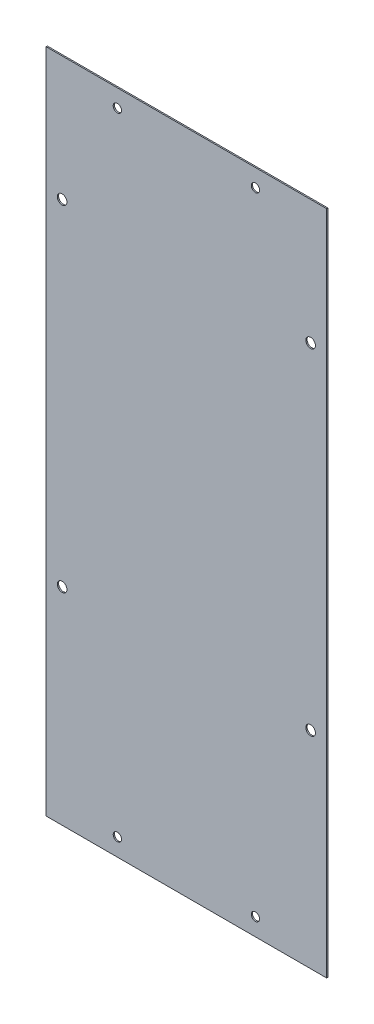
ISO-10303-21;
HEADER;
FILE_DESCRIPTION(('STEP AP214'),'2;1');
FILE_NAME('part.step','',(''),(''),'','','');
FILE_SCHEMA(('AUTOMOTIVE_DESIGN { 1 0 10303 214 1 1 1 1 }'));
ENDSEC;
DATA;
#1=APPLICATION_CONTEXT('core data for automotive mechanical design processes');
#2=APPLICATION_PROTOCOL_DEFINITION('international standard','automotive_design',2000,#1);
#3=PRODUCT_CONTEXT('',#1,'mechanical');
#4=PRODUCT('Part','Part','',(#3));
#5=PRODUCT_RELATED_PRODUCT_CATEGORY('part','',(#4));
#6=PRODUCT_DEFINITION_FORMATION('','',#4);
#7=PRODUCT_DEFINITION_CONTEXT('part definition',#1,'design');
#8=PRODUCT_DEFINITION('design','',#6,#7);
#9=PRODUCT_DEFINITION_SHAPE('','',#8);
#10=(LENGTH_UNIT() NAMED_UNIT(*) SI_UNIT(.MILLI.,.METRE.));
#11=(NAMED_UNIT(*) PLANE_ANGLE_UNIT() SI_UNIT($,.RADIAN.));
#12=(NAMED_UNIT(*) SI_UNIT($,.STERADIAN.) SOLID_ANGLE_UNIT());
#13=UNCERTAINTY_MEASURE_WITH_UNIT(LENGTH_MEASURE(1.E-05),#10,'distance_accuracy_value','');
#14=(GEOMETRIC_REPRESENTATION_CONTEXT(3) GLOBAL_UNCERTAINTY_ASSIGNED_CONTEXT((#13)) GLOBAL_UNIT_ASSIGNED_CONTEXT((#10,
#11,#12)) REPRESENTATION_CONTEXT('',''));
#15=CARTESIAN_POINT('',(0.,0.,0.));
#16=DIRECTION('',(0.,0.,1.));
#17=DIRECTION('',(1.,0.,0.));
#18=AXIS2_PLACEMENT_3D('',#15,#16,#17);
#19=CARTESIAN_POINT('',(101.6,-241.3,0.9));
#20=DIRECTION('',(-1.,0.,0.));
#21=DIRECTION('',(0.,0.,1.));
#22=AXIS2_PLACEMENT_3D('',#19,#20,#21);
#23=PLANE('',#22);
#24=DIRECTION('',(0.,1.,0.));
#25=VECTOR('',#24,1.);
#26=CARTESIAN_POINT('',(101.6,-241.3,0.));
#27=LINE('',#26,#25);
#28=CARTESIAN_POINT('',(101.6,-241.3,0.));
#29=VERTEX_POINT('',#28);
#30=CARTESIAN_POINT('',(101.6,241.3,0.));
#31=VERTEX_POINT('',#30);
#32=EDGE_CURVE('E103',#29,#31,#27,.T.);
#33=ORIENTED_EDGE('',*,*,#32,.T.);
#34=DIRECTION('',(0.,0.,-1.));
#35=VECTOR('',#34,1.);
#36=CARTESIAN_POINT('',(101.6,241.3,0.9));
#37=LINE('',#36,#35);
#38=CARTESIAN_POINT('',(101.6,241.3,0.9));
#39=VERTEX_POINT('',#38);
#40=EDGE_CURVE('E11',#39,#31,#37,.T.);
#41=ORIENTED_EDGE('',*,*,#40,.F.);
#42=DIRECTION('',(0.,1.,0.));
#43=VECTOR('',#42,1.);
#44=CARTESIAN_POINT('',(101.6,-241.3,0.9));
#45=LINE('',#44,#43);
#46=CARTESIAN_POINT('',(101.6,-241.3,0.9));
#47=VERTEX_POINT('',#46);
#48=EDGE_CURVE('E91',#47,#39,#45,.T.);
#49=ORIENTED_EDGE('',*,*,#48,.F.);
#50=DIRECTION('',(0.,0.,-1.));
#51=VECTOR('',#50,1.);
#52=CARTESIAN_POINT('',(101.6,-241.3,0.9));
#53=LINE('',#52,#51);
#54=EDGE_CURVE('E99',#47,#29,#53,.T.);
#55=ORIENTED_EDGE('',*,*,#54,.T.);
#56=EDGE_LOOP('',(#33,#41,#49,#55));
#57=FACE_BOUND('',#56,.T.);
#58=ADVANCED_FACE('F40',(#57),#23,.F.);
#59=CARTESIAN_POINT('',(-101.6,241.3,0.9));
#60=DIRECTION('',(0.,-1.,0.));
#61=DIRECTION('',(0.,0.,-1.));
#62=AXIS2_PLACEMENT_3D('',#59,#60,#61);
#63=PLANE('',#62);
#64=DIRECTION('',(-1.,0.,0.));
#65=VECTOR('',#64,1.);
#66=CARTESIAN_POINT('',(-101.6,241.3,0.));
#67=LINE('',#66,#65);
#68=CARTESIAN_POINT('',(-101.6,241.3,0.));
#69=VERTEX_POINT('',#68);
#70=EDGE_CURVE('E95',#31,#69,#67,.T.);
#71=ORIENTED_EDGE('',*,*,#70,.T.);
#72=DIRECTION('',(0.,0.,-1.));
#73=VECTOR('',#72,1.);
#74=CARTESIAN_POINT('',(-101.6,241.3,0.9));
#75=LINE('',#74,#73);
#76=CARTESIAN_POINT('',(-101.6,241.3,0.9));
#77=VERTEX_POINT('',#76);
#78=EDGE_CURVE('E48',#77,#69,#75,.T.);
#79=ORIENTED_EDGE('',*,*,#78,.F.);
#80=DIRECTION('',(-1.,0.,0.));
#81=VECTOR('',#80,1.);
#82=CARTESIAN_POINT('',(-101.6,241.3,0.9));
#83=LINE('',#82,#81);
#84=EDGE_CURVE('E86',#39,#77,#83,.T.);
#85=ORIENTED_EDGE('',*,*,#84,.F.);
#86=ORIENTED_EDGE('',*,*,#40,.T.);
#87=EDGE_LOOP('',(#71,#79,#85,#86));
#88=FACE_BOUND('',#87,.T.);
#89=ADVANCED_FACE('F94',(#88),#63,.F.);
#90=CARTESIAN_POINT('',(-101.6,-241.3,0.9));
#91=DIRECTION('',(1.,0.,0.));
#92=DIRECTION('',(0.,0.,-1.));
#93=AXIS2_PLACEMENT_3D('',#90,#91,#92);
#94=PLANE('',#93);
#95=DIRECTION('',(0.,-1.,0.));
#96=VECTOR('',#95,1.);
#97=CARTESIAN_POINT('',(-101.6,-241.3,0.));
#98=LINE('',#97,#96);
#99=CARTESIAN_POINT('',(-101.6,-241.3,0.));
#100=VERTEX_POINT('',#99);
#101=EDGE_CURVE('E73',#69,#100,#98,.T.);
#102=ORIENTED_EDGE('',*,*,#101,.T.);
#103=DIRECTION('',(0.,0.,-1.));
#104=VECTOR('',#103,1.);
#105=CARTESIAN_POINT('',(-101.6,-241.3,0.9));
#106=LINE('',#105,#104);
#107=CARTESIAN_POINT('',(-101.6,-241.3,0.9));
#108=VERTEX_POINT('',#107);
#109=EDGE_CURVE('E96',#108,#100,#106,.T.);
#110=ORIENTED_EDGE('',*,*,#109,.F.);
#111=DIRECTION('',(0.,-1.,0.));
#112=VECTOR('',#111,1.);
#113=CARTESIAN_POINT('',(-101.6,-241.3,0.9));
#114=LINE('',#113,#112);
#115=EDGE_CURVE('E89',#77,#108,#114,.T.);
#116=ORIENTED_EDGE('',*,*,#115,.F.);
#117=ORIENTED_EDGE('',*,*,#78,.T.);
#118=EDGE_LOOP('',(#102,#110,#116,#117));
#119=FACE_BOUND('',#118,.T.);
#120=ADVANCED_FACE('F97',(#119),#94,.F.);
#121=CARTESIAN_POINT('',(-101.6,-241.3,0.9));
#122=DIRECTION('',(0.,1.,0.));
#123=DIRECTION('',(0.,0.,1.));
#124=AXIS2_PLACEMENT_3D('',#121,#122,#123);
#125=PLANE('',#124);
#126=DIRECTION('',(1.,0.,0.));
#127=VECTOR('',#126,1.);
#128=CARTESIAN_POINT('',(-101.6,-241.3,0.));
#129=LINE('',#128,#127);
#130=EDGE_CURVE('E79',#100,#29,#129,.T.);
#131=ORIENTED_EDGE('',*,*,#130,.T.);
#132=ORIENTED_EDGE('',*,*,#54,.F.);
#133=DIRECTION('',(1.,0.,0.));
#134=VECTOR('',#133,1.);
#135=CARTESIAN_POINT('',(-101.6,-241.3,0.9));
#136=LINE('',#135,#134);
#137=EDGE_CURVE('E56',#108,#47,#136,.T.);
#138=ORIENTED_EDGE('',*,*,#137,.F.);
#139=ORIENTED_EDGE('',*,*,#109,.T.);
#140=EDGE_LOOP('',(#131,#132,#138,#139));
#141=FACE_BOUND('',#140,.T.);
#142=ADVANCED_FACE('F111',(#141),#125,.F.);
#143=CARTESIAN_POINT('',(0.,0.,0.9));
#144=DIRECTION('',(0.,0.,-1.));
#145=DIRECTION('',(-1.,0.,0.));
#146=AXIS2_PLACEMENT_3D('',#143,#144,#145);
#147=PLANE('',#146);
#148=CARTESIAN_POINT('',(-50.,-228.6,0.9));
#149=DIRECTION('',(0.,0.,1.));
#150=DIRECTION('',(1.,0.,0.));
#151=AXIS2_PLACEMENT_3D('',#148,#149,#150);
#152=CIRCLE('',#151,3.00000000000001);
#153=CARTESIAN_POINT('',(-47.,-228.6,0.9));
#154=VERTEX_POINT('',#153);
#155=EDGE_CURVE('E147',#154,#154,#152,.T.);
#156=ORIENTED_EDGE('',*,*,#155,.F.);
#157=EDGE_LOOP('',(#156));
#158=FACE_BOUND('',#157,.T.);
#159=CARTESIAN_POINT('',(50.,-228.6,0.9));
#160=DIRECTION('',(0.,0.,1.));
#161=DIRECTION('',(1.,0.,0.));
#162=AXIS2_PLACEMENT_3D('',#159,#160,#161);
#163=CIRCLE('',#162,2.99999999999999);
#164=CARTESIAN_POINT('',(53.,-228.6,0.9));
#165=VERTEX_POINT('',#164);
#166=EDGE_CURVE('E153',#165,#165,#163,.T.);
#167=ORIENTED_EDGE('',*,*,#166,.F.);
#168=EDGE_LOOP('',(#167));
#169=FACE_BOUND('',#168,.T.);
#170=CARTESIAN_POINT('',(50.,228.6,0.9));
#171=DIRECTION('',(0.,0.,1.));
#172=DIRECTION('',(1.,0.,0.));
#173=AXIS2_PLACEMENT_3D('',#170,#171,#172);
#174=CIRCLE('',#173,3.00000000000001);
#175=CARTESIAN_POINT('',(53.,228.6,0.9));
#176=VERTEX_POINT('',#175);
#177=EDGE_CURVE('E159',#176,#176,#174,.T.);
#178=ORIENTED_EDGE('',*,*,#177,.F.);
#179=EDGE_LOOP('',(#178));
#180=FACE_BOUND('',#179,.T.);
#181=CARTESIAN_POINT('',(-50.,228.6,0.9));
#182=DIRECTION('',(0.,0.,1.));
#183=DIRECTION('',(1.,0.,0.));
#184=AXIS2_PLACEMENT_3D('',#181,#182,#183);
#185=CIRCLE('',#184,2.99999999999999);
#186=CARTESIAN_POINT('',(-47.,228.6,0.9));
#187=VERTEX_POINT('',#186);
#188=EDGE_CURVE('E141',#187,#187,#185,.T.);
#189=ORIENTED_EDGE('',*,*,#188,.F.);
#190=EDGE_LOOP('',(#189));
#191=FACE_BOUND('',#190,.T.);
#192=CARTESIAN_POINT('',(-90.,-91.7,0.9));
#193=DIRECTION('',(0.,0.,1.));
#194=DIRECTION('',(1.,0.,0.));
#195=AXIS2_PLACEMENT_3D('',#192,#193,#194);
#196=CIRCLE('',#195,3.49999999999999);
#197=CARTESIAN_POINT('',(-86.5,-91.7,0.9));
#198=VERTEX_POINT('',#197);
#199=EDGE_CURVE('E123',#198,#198,#196,.T.);
#200=ORIENTED_EDGE('',*,*,#199,.F.);
#201=EDGE_LOOP('',(#200));
#202=FACE_BOUND('',#201,.T.);
#203=CARTESIAN_POINT('',(90.,-91.7,0.9));
#204=DIRECTION('',(0.,0.,1.));
#205=DIRECTION('',(1.,0.,0.));
#206=AXIS2_PLACEMENT_3D('',#203,#204,#205);
#207=CIRCLE('',#206,3.50000000000001);
#208=CARTESIAN_POINT('',(93.5,-91.7,0.9));
#209=VERTEX_POINT('',#208);
#210=EDGE_CURVE('E130',#209,#209,#207,.T.);
#211=ORIENTED_EDGE('',*,*,#210,.F.);
#212=EDGE_LOOP('',(#211));
#213=FACE_BOUND('',#212,.T.);
#214=CARTESIAN_POINT('',(90.,151.3,0.9));
#215=DIRECTION('',(0.,0.,1.));
#216=DIRECTION('',(1.,0.,0.));
#217=AXIS2_PLACEMENT_3D('',#214,#215,#216);
#218=CIRCLE('',#217,3.49999999999999);
#219=CARTESIAN_POINT('',(93.5,151.3,0.9));
#220=VERTEX_POINT('',#219);
#221=EDGE_CURVE('E136',#220,#220,#218,.T.);
#222=ORIENTED_EDGE('',*,*,#221,.F.);
#223=EDGE_LOOP('',(#222));
#224=FACE_BOUND('',#223,.T.);
#225=CARTESIAN_POINT('',(-90.,151.3,0.9));
#226=DIRECTION('',(0.,0.,1.));
#227=DIRECTION('',(1.,0.,0.));
#228=AXIS2_PLACEMENT_3D('',#225,#226,#227);
#229=CIRCLE('',#228,3.49999999999999);
#230=CARTESIAN_POINT('',(-86.5,151.3,0.9));
#231=VERTEX_POINT('',#230);
#232=EDGE_CURVE('E117',#231,#231,#229,.T.);
#233=ORIENTED_EDGE('',*,*,#232,.F.);
#234=EDGE_LOOP('',(#233));
#235=FACE_BOUND('',#234,.T.);
#236=ORIENTED_EDGE('',*,*,#48,.T.);
#237=ORIENTED_EDGE('',*,*,#84,.T.);
#238=ORIENTED_EDGE('',*,*,#115,.T.);
#239=ORIENTED_EDGE('',*,*,#137,.T.);
#240=EDGE_LOOP('',(#236,#237,#238,#239));
#241=FACE_BOUND('',#240,.T.);
#242=ADVANCED_FACE('F87',(#158,#169,#180,#191,#202,#213,#224,#235,#241),#147,.F.);
#243=CARTESIAN_POINT('',(0.,0.,0.));
#244=DIRECTION('',(0.,0.,-1.));
#245=DIRECTION('',(-1.,0.,0.));
#246=AXIS2_PLACEMENT_3D('',#243,#244,#245);
#247=PLANE('',#246);
#248=CARTESIAN_POINT('',(-50.,-228.6,0.));
#249=DIRECTION('',(0.,0.,1.));
#250=DIRECTION('',(1.,0.,0.));
#251=AXIS2_PLACEMENT_3D('',#248,#249,#250);
#252=CIRCLE('',#251,3.00000000000001);
#253=CARTESIAN_POINT('',(-47.,-228.6,0.));
#254=VERTEX_POINT('',#253);
#255=EDGE_CURVE('E150',#254,#254,#252,.T.);
#256=ORIENTED_EDGE('',*,*,#255,.T.);
#257=EDGE_LOOP('',(#256));
#258=FACE_BOUND('',#257,.T.);
#259=CARTESIAN_POINT('',(50.,-228.6,0.));
#260=DIRECTION('',(0.,0.,1.));
#261=DIRECTION('',(1.,0.,0.));
#262=AXIS2_PLACEMENT_3D('',#259,#260,#261);
#263=CIRCLE('',#262,2.99999999999999);
#264=CARTESIAN_POINT('',(53.,-228.6,0.));
#265=VERTEX_POINT('',#264);
#266=EDGE_CURVE('E156',#265,#265,#263,.T.);
#267=ORIENTED_EDGE('',*,*,#266,.T.);
#268=EDGE_LOOP('',(#267));
#269=FACE_BOUND('',#268,.T.);
#270=CARTESIAN_POINT('',(50.,228.6,0.));
#271=DIRECTION('',(0.,0.,1.));
#272=DIRECTION('',(1.,0.,0.));
#273=AXIS2_PLACEMENT_3D('',#270,#271,#272);
#274=CIRCLE('',#273,3.00000000000001);
#275=CARTESIAN_POINT('',(53.,228.6,0.));
#276=VERTEX_POINT('',#275);
#277=EDGE_CURVE('E144',#276,#276,#274,.T.);
#278=ORIENTED_EDGE('',*,*,#277,.T.);
#279=EDGE_LOOP('',(#278));
#280=FACE_BOUND('',#279,.T.);
#281=CARTESIAN_POINT('',(-50.,228.6,0.));
#282=DIRECTION('',(0.,0.,1.));
#283=DIRECTION('',(1.,0.,0.));
#284=AXIS2_PLACEMENT_3D('',#281,#282,#283);
#285=CIRCLE('',#284,2.99999999999999);
#286=CARTESIAN_POINT('',(-47.,228.6,0.));
#287=VERTEX_POINT('',#286);
#288=EDGE_CURVE('E127',#287,#287,#285,.T.);
#289=ORIENTED_EDGE('',*,*,#288,.T.);
#290=EDGE_LOOP('',(#289));
#291=FACE_BOUND('',#290,.T.);
#292=CARTESIAN_POINT('',(-90.,-91.7,0.));
#293=DIRECTION('',(0.,0.,1.));
#294=DIRECTION('',(1.,0.,0.));
#295=AXIS2_PLACEMENT_3D('',#292,#293,#294);
#296=CIRCLE('',#295,3.49999999999999);
#297=CARTESIAN_POINT('',(-86.5,-91.7,0.));
#298=VERTEX_POINT('',#297);
#299=EDGE_CURVE('E126',#298,#298,#296,.T.);
#300=ORIENTED_EDGE('',*,*,#299,.T.);
#301=EDGE_LOOP('',(#300));
#302=FACE_BOUND('',#301,.T.);
#303=CARTESIAN_POINT('',(90.,-91.7,0.));
#304=DIRECTION('',(0.,0.,1.));
#305=DIRECTION('',(1.,0.,0.));
#306=AXIS2_PLACEMENT_3D('',#303,#304,#305);
#307=CIRCLE('',#306,3.50000000000001);
#308=CARTESIAN_POINT('',(93.5,-91.7,0.));
#309=VERTEX_POINT('',#308);
#310=EDGE_CURVE('E133',#309,#309,#307,.T.);
#311=ORIENTED_EDGE('',*,*,#310,.T.);
#312=EDGE_LOOP('',(#311));
#313=FACE_BOUND('',#312,.T.);
#314=CARTESIAN_POINT('',(90.,151.3,0.));
#315=DIRECTION('',(0.,0.,1.));
#316=DIRECTION('',(1.,0.,0.));
#317=AXIS2_PLACEMENT_3D('',#314,#315,#316);
#318=CIRCLE('',#317,3.49999999999999);
#319=CARTESIAN_POINT('',(93.5,151.3,0.));
#320=VERTEX_POINT('',#319);
#321=EDGE_CURVE('E120',#320,#320,#318,.T.);
#322=ORIENTED_EDGE('',*,*,#321,.T.);
#323=EDGE_LOOP('',(#322));
#324=FACE_BOUND('',#323,.T.);
#325=CARTESIAN_POINT('',(-90.,151.3,0.));
#326=DIRECTION('',(0.,0.,1.));
#327=DIRECTION('',(1.,0.,0.));
#328=AXIS2_PLACEMENT_3D('',#325,#326,#327);
#329=CIRCLE('',#328,3.49999999999999);
#330=CARTESIAN_POINT('',(-86.5,151.3,0.));
#331=VERTEX_POINT('',#330);
#332=EDGE_CURVE('E106',#331,#331,#329,.T.);
#333=ORIENTED_EDGE('',*,*,#332,.T.);
#334=EDGE_LOOP('',(#333));
#335=FACE_BOUND('',#334,.T.);
#336=ORIENTED_EDGE('',*,*,#32,.F.);
#337=ORIENTED_EDGE('',*,*,#130,.F.);
#338=ORIENTED_EDGE('',*,*,#101,.F.);
#339=ORIENTED_EDGE('',*,*,#70,.F.);
#340=EDGE_LOOP('',(#336,#337,#338,#339));
#341=FACE_BOUND('',#340,.T.);
#342=ADVANCED_FACE('F114',(#258,#269,#280,#291,#302,#313,#324,#335,#341),#247,.T.);
#343=CARTESIAN_POINT('',(-90.,151.3,0.));
#344=DIRECTION('',(0.,0.,1.));
#345=DIRECTION('',(1.,0.,0.));
#346=AXIS2_PLACEMENT_3D('',#343,#344,#345);
#347=CYLINDRICAL_SURFACE('',#346,3.49999999999999);
#348=ORIENTED_EDGE('',*,*,#332,.F.);
#349=EDGE_LOOP('',(#348));
#350=FACE_BOUND('',#349,.T.);
#351=ORIENTED_EDGE('',*,*,#232,.T.);
#352=EDGE_LOOP('',(#351));
#353=FACE_BOUND('',#352,.T.);
#354=ADVANCED_FACE('F189',(#350,#353),#347,.F.);
#355=CARTESIAN_POINT('',(90.,151.3,0.));
#356=DIRECTION('',(0.,0.,1.));
#357=DIRECTION('',(1.,0.,0.));
#358=AXIS2_PLACEMENT_3D('',#355,#356,#357);
#359=CYLINDRICAL_SURFACE('',#358,3.49999999999999);
#360=ORIENTED_EDGE('',*,*,#321,.F.);
#361=EDGE_LOOP('',(#360));
#362=FACE_BOUND('',#361,.T.);
#363=ORIENTED_EDGE('',*,*,#221,.T.);
#364=EDGE_LOOP('',(#363));
#365=FACE_BOUND('',#364,.T.);
#366=ADVANCED_FACE('F191',(#362,#365),#359,.F.);
#367=CARTESIAN_POINT('',(90.,-91.7,0.));
#368=DIRECTION('',(0.,0.,1.));
#369=DIRECTION('',(1.,0.,0.));
#370=AXIS2_PLACEMENT_3D('',#367,#368,#369);
#371=CYLINDRICAL_SURFACE('',#370,3.50000000000001);
#372=ORIENTED_EDGE('',*,*,#310,.F.);
#373=EDGE_LOOP('',(#372));
#374=FACE_BOUND('',#373,.T.);
#375=ORIENTED_EDGE('',*,*,#210,.T.);
#376=EDGE_LOOP('',(#375));
#377=FACE_BOUND('',#376,.T.);
#378=ADVANCED_FACE('F198',(#374,#377),#371,.F.);
#379=CARTESIAN_POINT('',(-90.,-91.7,0.));
#380=DIRECTION('',(0.,0.,1.));
#381=DIRECTION('',(1.,0.,0.));
#382=AXIS2_PLACEMENT_3D('',#379,#380,#381);
#383=CYLINDRICAL_SURFACE('',#382,3.49999999999999);
#384=ORIENTED_EDGE('',*,*,#299,.F.);
#385=EDGE_LOOP('',(#384));
#386=FACE_BOUND('',#385,.T.);
#387=ORIENTED_EDGE('',*,*,#199,.T.);
#388=EDGE_LOOP('',(#387));
#389=FACE_BOUND('',#388,.T.);
#390=ADVANCED_FACE('F238',(#386,#389),#383,.F.);
#391=CARTESIAN_POINT('',(-50.,228.6,0.));
#392=DIRECTION('',(0.,0.,1.));
#393=DIRECTION('',(1.,0.,0.));
#394=AXIS2_PLACEMENT_3D('',#391,#392,#393);
#395=CYLINDRICAL_SURFACE('',#394,2.99999999999999);
#396=ORIENTED_EDGE('',*,*,#288,.F.);
#397=EDGE_LOOP('',(#396));
#398=FACE_BOUND('',#397,.T.);
#399=ORIENTED_EDGE('',*,*,#188,.T.);
#400=EDGE_LOOP('',(#399));
#401=FACE_BOUND('',#400,.T.);
#402=ADVANCED_FACE('F171',(#398,#401),#395,.F.);
#403=CARTESIAN_POINT('',(50.,228.6,0.));
#404=DIRECTION('',(0.,0.,1.));
#405=DIRECTION('',(1.,0.,0.));
#406=AXIS2_PLACEMENT_3D('',#403,#404,#405);
#407=CYLINDRICAL_SURFACE('',#406,3.00000000000001);
#408=ORIENTED_EDGE('',*,*,#277,.F.);
#409=EDGE_LOOP('',(#408));
#410=FACE_BOUND('',#409,.T.);
#411=ORIENTED_EDGE('',*,*,#177,.T.);
#412=EDGE_LOOP('',(#411));
#413=FACE_BOUND('',#412,.T.);
#414=ADVANCED_FACE('F167',(#410,#413),#407,.F.);
#415=CARTESIAN_POINT('',(50.,-228.6,0.));
#416=DIRECTION('',(0.,0.,1.));
#417=DIRECTION('',(1.,0.,0.));
#418=AXIS2_PLACEMENT_3D('',#415,#416,#417);
#419=CYLINDRICAL_SURFACE('',#418,2.99999999999999);
#420=ORIENTED_EDGE('',*,*,#266,.F.);
#421=EDGE_LOOP('',(#420));
#422=FACE_BOUND('',#421,.T.);
#423=ORIENTED_EDGE('',*,*,#166,.T.);
#424=EDGE_LOOP('',(#423));
#425=FACE_BOUND('',#424,.T.);
#426=ADVANCED_FACE('F170',(#422,#425),#419,.F.);
#427=CARTESIAN_POINT('',(-50.,-228.6,0.));
#428=DIRECTION('',(0.,0.,1.));
#429=DIRECTION('',(1.,0.,0.));
#430=AXIS2_PLACEMENT_3D('',#427,#428,#429);
#431=CYLINDRICAL_SURFACE('',#430,3.00000000000001);
#432=ORIENTED_EDGE('',*,*,#255,.F.);
#433=EDGE_LOOP('',(#432));
#434=FACE_BOUND('',#433,.T.);
#435=ORIENTED_EDGE('',*,*,#155,.T.);
#436=EDGE_LOOP('',(#435));
#437=FACE_BOUND('',#436,.T.);
#438=ADVANCED_FACE('F256',(#434,#437),#431,.F.);
#439=CLOSED_SHELL('',(#58,#89,#120,#142,#242,#342,#354,#366,#378,#390,#402,#414,#426,#438));
#440=MANIFOLD_SOLID_BREP('B2',#439);
#441=ADVANCED_BREP_SHAPE_REPRESENTATION('',(#18,#440),#14);
#442=SHAPE_DEFINITION_REPRESENTATION(#9,#441);
ENDSEC;
END-ISO-10303-21;
